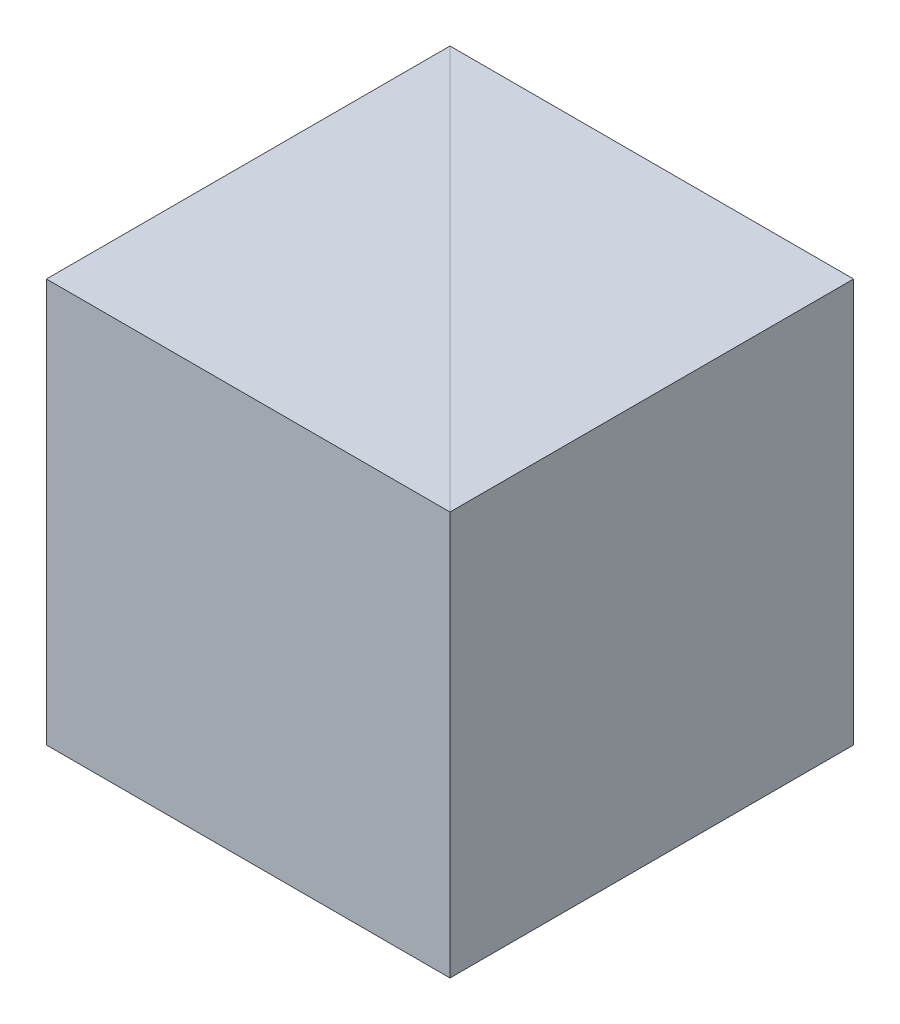
ISO-10303-21;
HEADER;
FILE_DESCRIPTION(('STEP AP214'),'2;1');
FILE_NAME('part.step','',(''),(''),'','','');
FILE_SCHEMA(('AUTOMOTIVE_DESIGN { 1 0 10303 214 1 1 1 1 }'));
ENDSEC;
DATA;
#1=APPLICATION_CONTEXT('core data for automotive mechanical design processes');
#2=APPLICATION_PROTOCOL_DEFINITION('international standard','automotive_design',2000,#1);
#3=PRODUCT_CONTEXT('',#1,'mechanical');
#4=PRODUCT('Part','Part','',(#3));
#5=PRODUCT_RELATED_PRODUCT_CATEGORY('part','',(#4));
#6=PRODUCT_DEFINITION_FORMATION('','',#4);
#7=PRODUCT_DEFINITION_CONTEXT('part definition',#1,'design');
#8=PRODUCT_DEFINITION('design','',#6,#7);
#9=PRODUCT_DEFINITION_SHAPE('','',#8);
#10=(LENGTH_UNIT() NAMED_UNIT(*) SI_UNIT(.MILLI.,.METRE.));
#11=(NAMED_UNIT(*) PLANE_ANGLE_UNIT() SI_UNIT($,.RADIAN.));
#12=(NAMED_UNIT(*) SI_UNIT($,.STERADIAN.) SOLID_ANGLE_UNIT());
#13=UNCERTAINTY_MEASURE_WITH_UNIT(LENGTH_MEASURE(1.E-05),#10,'distance_accuracy_value','');
#14=(GEOMETRIC_REPRESENTATION_CONTEXT(3) GLOBAL_UNCERTAINTY_ASSIGNED_CONTEXT((#13)) GLOBAL_UNIT_ASSIGNED_CONTEXT((#10,
#11,#12)) REPRESENTATION_CONTEXT('',''));
#15=CARTESIAN_POINT('',(0.,0.,0.));
#16=DIRECTION('',(0.,0.,1.));
#17=DIRECTION('',(1.,0.,0.));
#18=AXIS2_PLACEMENT_3D('',#15,#16,#17);
#19=CARTESIAN_POINT('',(0.,15.,0.));
#20=DIRECTION('',(0.707106781186547,0.,-0.707106781186548));
#21=DIRECTION('',(-0.707106781186548,0.,-0.707106781186547));
#22=AXIS2_PLACEMENT_3D('',#19,#20,#21);
#23=PLANE('',#22);
#24=DIRECTION('',(0.707106781186548,0.,0.707106781186547));
#25=VECTOR('',#24,1.);
#26=CARTESIAN_POINT('',(0.,0.,0.));
#27=LINE('',#26,#25);
#28=CARTESIAN_POINT('',(-15.,0.,-15.));
#29=VERTEX_POINT('',#28);
#30=CARTESIAN_POINT('',(0.,0.,0.));
#31=VERTEX_POINT('',#30);
#32=EDGE_CURVE('E97',#29,#31,#27,.T.);
#33=ORIENTED_EDGE('',*,*,#32,.F.);
#34=DIRECTION('',(0.,-1.,0.));
#35=VECTOR('',#34,1.);
#36=CARTESIAN_POINT('',(-15.,15.,-15.));
#37=LINE('',#36,#35);
#38=CARTESIAN_POINT('',(-15.,15.,-15.));
#39=VERTEX_POINT('',#38);
#40=EDGE_CURVE('E12',#39,#29,#37,.T.);
#41=ORIENTED_EDGE('',*,*,#40,.F.);
#42=DIRECTION('',(0.707106781186548,0.,0.707106781186547));
#43=VECTOR('',#42,1.);
#44=CARTESIAN_POINT('',(0.,15.,0.));
#45=LINE('',#44,#43);
#46=CARTESIAN_POINT('',(0.,15.,0.));
#47=VERTEX_POINT('',#46);
#48=EDGE_CURVE('E89',#39,#47,#45,.T.);
#49=ORIENTED_EDGE('',*,*,#48,.T.);
#50=DIRECTION('',(0.,-1.,0.));
#51=VECTOR('',#50,1.);
#52=CARTESIAN_POINT('',(0.,15.,0.));
#53=LINE('',#52,#51);
#54=EDGE_CURVE('E48',#47,#31,#53,.T.);
#55=ORIENTED_EDGE('',*,*,#54,.T.);
#56=EDGE_LOOP('',(#33,#41,#49,#55));
#57=FACE_BOUND('',#56,.T.);
#58=ADVANCED_FACE('F45',(#57),#23,.T.);
#59=CARTESIAN_POINT('',(-15.,15.,-15.));
#60=DIRECTION('',(-1.,0.,0.));
#61=DIRECTION('',(0.,0.,1.));
#62=AXIS2_PLACEMENT_3D('',#59,#60,#61);
#63=PLANE('',#62);
#64=DIRECTION('',(0.,0.,-1.));
#65=VECTOR('',#64,1.);
#66=CARTESIAN_POINT('',(-15.,0.,-15.));
#67=LINE('',#66,#65);
#68=CARTESIAN_POINT('',(-15.,0.,0.));
#69=VERTEX_POINT('',#68);
#70=EDGE_CURVE('E91',#69,#29,#67,.T.);
#71=ORIENTED_EDGE('',*,*,#70,.F.);
#72=DIRECTION('',(0.,-1.,0.));
#73=VECTOR('',#72,1.);
#74=CARTESIAN_POINT('',(-15.,15.,0.));
#75=LINE('',#74,#73);
#76=CARTESIAN_POINT('',(-15.,15.,0.));
#77=VERTEX_POINT('',#76);
#78=EDGE_CURVE('E54',#77,#69,#75,.T.);
#79=ORIENTED_EDGE('',*,*,#78,.F.);
#80=DIRECTION('',(0.,0.,-1.));
#81=VECTOR('',#80,1.);
#82=CARTESIAN_POINT('',(-15.,15.,-15.));
#83=LINE('',#82,#81);
#84=EDGE_CURVE('E86',#77,#39,#83,.T.);
#85=ORIENTED_EDGE('',*,*,#84,.T.);
#86=ORIENTED_EDGE('',*,*,#40,.T.);
#87=EDGE_LOOP('',(#71,#79,#85,#86));
#88=FACE_BOUND('',#87,.T.);
#89=ADVANCED_FACE('F101',(#88),#63,.T.);
#90=CARTESIAN_POINT('',(-15.,15.,0.));
#91=DIRECTION('',(0.,0.,1.));
#92=DIRECTION('',(1.,0.,0.));
#93=AXIS2_PLACEMENT_3D('',#90,#91,#92);
#94=PLANE('',#93);
#95=DIRECTION('',(-1.,0.,0.));
#96=VECTOR('',#95,1.);
#97=CARTESIAN_POINT('',(-15.,0.,0.));
#98=LINE('',#97,#96);
#99=EDGE_CURVE('E84',#31,#69,#98,.T.);
#100=ORIENTED_EDGE('',*,*,#99,.F.);
#101=ORIENTED_EDGE('',*,*,#54,.F.);
#102=DIRECTION('',(-1.,0.,0.));
#103=VECTOR('',#102,1.);
#104=CARTESIAN_POINT('',(-15.,15.,0.));
#105=LINE('',#104,#103);
#106=EDGE_CURVE('E82',#47,#77,#105,.T.);
#107=ORIENTED_EDGE('',*,*,#106,.T.);
#108=ORIENTED_EDGE('',*,*,#78,.T.);
#109=EDGE_LOOP('',(#100,#101,#107,#108));
#110=FACE_BOUND('',#109,.T.);
#111=ADVANCED_FACE('F81',(#110),#94,.T.);
#112=CARTESIAN_POINT('',(0.,15.,0.));
#113=DIRECTION('',(0.,1.,0.));
#114=DIRECTION('',(0.,0.,1.));
#115=AXIS2_PLACEMENT_3D('',#112,#113,#114);
#116=PLANE('',#115);
#117=ORIENTED_EDGE('',*,*,#48,.F.);
#118=ORIENTED_EDGE('',*,*,#84,.F.);
#119=ORIENTED_EDGE('',*,*,#106,.F.);
#120=EDGE_LOOP('',(#117,#118,#119));
#121=FACE_BOUND('',#120,.T.);
#122=ADVANCED_FACE('F88',(#121),#116,.T.);
#123=CARTESIAN_POINT('',(0.,0.,0.));
#124=DIRECTION('',(0.,1.,0.));
#125=DIRECTION('',(0.,0.,1.));
#126=AXIS2_PLACEMENT_3D('',#123,#124,#125);
#127=PLANE('',#126);
#128=ORIENTED_EDGE('',*,*,#32,.T.);
#129=ORIENTED_EDGE('',*,*,#99,.T.);
#130=ORIENTED_EDGE('',*,*,#70,.T.);
#131=EDGE_LOOP('',(#128,#129,#130));
#132=FACE_BOUND('',#131,.T.);
#133=ADVANCED_FACE('F100',(#132),#127,.F.);
#134=CLOSED_SHELL('',(#58,#89,#111,#122,#133));
#135=MANIFOLD_SOLID_BREP('B2',#134);
#136=CARTESIAN_POINT('',(-15.,15.,-15.));
#137=DIRECTION('',(0.707106781186547,0.,-0.707106781186548));
#138=DIRECTION('',(-0.707106781186548,0.,-0.707106781186547));
#139=AXIS2_PLACEMENT_3D('',#136,#137,#138);
#140=PLANE('',#139);
#141=DIRECTION('',(0.707106781186548,0.,0.707106781186547));
#142=VECTOR('',#141,1.);
#143=CARTESIAN_POINT('',(-15.,0.,-15.));
#144=LINE('',#143,#142);
#145=CARTESIAN_POINT('',(-15.,0.,-15.));
#146=VERTEX_POINT('',#145);
#147=CARTESIAN_POINT('',(0.,0.,0.));
#148=VERTEX_POINT('',#147);
#149=EDGE_CURVE('E190',#146,#148,#144,.T.);
#150=ORIENTED_EDGE('',*,*,#149,.T.);
#151=DIRECTION('',(0.,-1.,0.));
#152=VECTOR('',#151,1.);
#153=CARTESIAN_POINT('',(0.,15.,0.));
#154=LINE('',#153,#152);
#155=CARTESIAN_POINT('',(0.,15.,0.));
#156=VERTEX_POINT('',#155);
#157=EDGE_CURVE('E43',#156,#148,#154,.T.);
#158=ORIENTED_EDGE('',*,*,#157,.F.);
#159=DIRECTION('',(0.707106781186548,0.,0.707106781186547));
#160=VECTOR('',#159,1.);
#161=CARTESIAN_POINT('',(-15.,15.,-15.));
#162=LINE('',#161,#160);
#163=CARTESIAN_POINT('',(-15.,15.,-15.));
#164=VERTEX_POINT('',#163);
#165=EDGE_CURVE('E183',#164,#156,#162,.T.);
#166=ORIENTED_EDGE('',*,*,#165,.F.);
#167=DIRECTION('',(0.,-1.,0.));
#168=VECTOR('',#167,1.);
#169=CARTESIAN_POINT('',(-15.,15.,-15.));
#170=LINE('',#169,#168);
#171=EDGE_CURVE('E191',#164,#146,#170,.T.);
#172=ORIENTED_EDGE('',*,*,#171,.T.);
#173=EDGE_LOOP('',(#150,#158,#166,#172));
#174=FACE_BOUND('',#173,.T.);
#175=ADVANCED_FACE('F143',(#174),#140,.F.);
#176=CARTESIAN_POINT('',(0.,15.,0.));
#177=DIRECTION('',(-1.,0.,0.));
#178=DIRECTION('',(0.,0.,1.));
#179=AXIS2_PLACEMENT_3D('',#176,#177,#178);
#180=PLANE('',#179);
#181=DIRECTION('',(0.,0.,-1.));
#182=VECTOR('',#181,1.);
#183=CARTESIAN_POINT('',(0.,0.,0.));
#184=LINE('',#183,#182);
#185=CARTESIAN_POINT('',(0.,0.,-15.));
#186=VERTEX_POINT('',#185);
#187=EDGE_CURVE('E171',#148,#186,#184,.T.);
#188=ORIENTED_EDGE('',*,*,#187,.T.);
#189=DIRECTION('',(0.,-1.,0.));
#190=VECTOR('',#189,1.);
#191=CARTESIAN_POINT('',(0.,15.,-15.));
#192=LINE('',#191,#190);
#193=CARTESIAN_POINT('',(0.,15.,-15.));
#194=VERTEX_POINT('',#193);
#195=EDGE_CURVE('E151',#194,#186,#192,.T.);
#196=ORIENTED_EDGE('',*,*,#195,.F.);
#197=DIRECTION('',(0.,0.,-1.));
#198=VECTOR('',#197,1.);
#199=CARTESIAN_POINT('',(0.,15.,0.));
#200=LINE('',#199,#198);
#201=EDGE_CURVE('E179',#156,#194,#200,.T.);
#202=ORIENTED_EDGE('',*,*,#201,.F.);
#203=ORIENTED_EDGE('',*,*,#157,.T.);
#204=EDGE_LOOP('',(#188,#196,#202,#203));
#205=FACE_BOUND('',#204,.T.);
#206=ADVANCED_FACE('F180',(#205),#180,.F.);
#207=CARTESIAN_POINT('',(0.,15.,-15.));
#208=DIRECTION('',(0.,0.,1.));
#209=DIRECTION('',(1.,0.,0.));
#210=AXIS2_PLACEMENT_3D('',#207,#208,#209);
#211=PLANE('',#210);
#212=DIRECTION('',(-1.,0.,0.));
#213=VECTOR('',#212,1.);
#214=CARTESIAN_POINT('',(0.,0.,-15.));
#215=LINE('',#214,#213);
#216=EDGE_CURVE('E176',#186,#146,#215,.T.);
#217=ORIENTED_EDGE('',*,*,#216,.T.);
#218=ORIENTED_EDGE('',*,*,#171,.F.);
#219=DIRECTION('',(-1.,0.,0.));
#220=VECTOR('',#219,1.);
#221=CARTESIAN_POINT('',(0.,15.,-15.));
#222=LINE('',#221,#220);
#223=EDGE_CURVE('E159',#194,#164,#222,.T.);
#224=ORIENTED_EDGE('',*,*,#223,.F.);
#225=ORIENTED_EDGE('',*,*,#195,.T.);
#226=EDGE_LOOP('',(#217,#218,#224,#225));
#227=FACE_BOUND('',#226,.T.);
#228=ADVANCED_FACE('F198',(#227),#211,.F.);
#229=CARTESIAN_POINT('',(0.,15.,0.));
#230=DIRECTION('',(0.,1.,0.));
#231=DIRECTION('',(0.,0.,1.));
#232=AXIS2_PLACEMENT_3D('',#229,#230,#231);
#233=PLANE('',#232);
#234=ORIENTED_EDGE('',*,*,#165,.T.);
#235=ORIENTED_EDGE('',*,*,#201,.T.);
#236=ORIENTED_EDGE('',*,*,#223,.T.);
#237=EDGE_LOOP('',(#234,#235,#236));
#238=FACE_BOUND('',#237,.T.);
#239=ADVANCED_FACE('F186',(#238),#233,.T.);
#240=CARTESIAN_POINT('',(0.,0.,0.));
#241=DIRECTION('',(0.,1.,0.));
#242=DIRECTION('',(0.,0.,1.));
#243=AXIS2_PLACEMENT_3D('',#240,#241,#242);
#244=PLANE('',#243);
#245=ORIENTED_EDGE('',*,*,#149,.F.);
#246=ORIENTED_EDGE('',*,*,#216,.F.);
#247=ORIENTED_EDGE('',*,*,#187,.F.);
#248=EDGE_LOOP('',(#245,#246,#247));
#249=FACE_BOUND('',#248,.T.);
#250=ADVANCED_FACE('F199',(#249),#244,.F.);
#251=CLOSED_SHELL('',(#175,#206,#228,#239,#250));
#252=MANIFOLD_SOLID_BREP('B6',#251);
#253=ADVANCED_BREP_SHAPE_REPRESENTATION('',(#18,#135,#252),#14);
#254=SHAPE_DEFINITION_REPRESENTATION(#9,#253);
ENDSEC;
END-ISO-10303-21;
